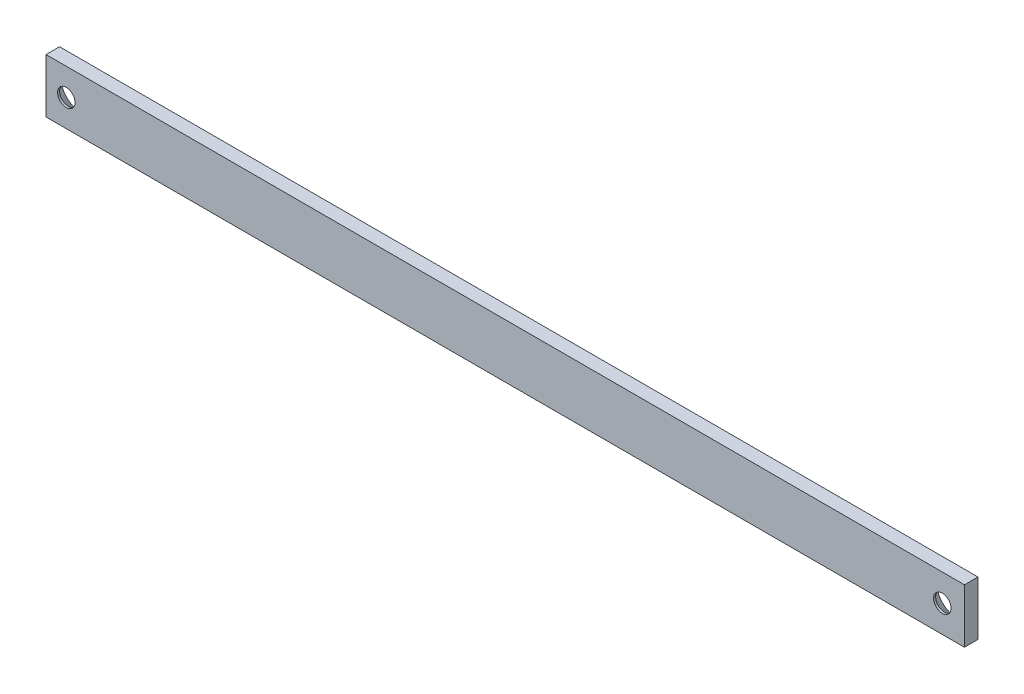
ISO-10303-21;
HEADER;
FILE_DESCRIPTION(('STEP AP214'),'2;1');
FILE_NAME('part.step','',(''),(''),'','','');
FILE_SCHEMA(('AUTOMOTIVE_DESIGN { 1 0 10303 214 1 1 1 1 }'));
ENDSEC;
DATA;
#1=APPLICATION_CONTEXT('core data for automotive mechanical design processes');
#2=APPLICATION_PROTOCOL_DEFINITION('international standard','automotive_design',2000,#1);
#3=PRODUCT_CONTEXT('',#1,'mechanical');
#4=PRODUCT('Part','Part','',(#3));
#5=PRODUCT_RELATED_PRODUCT_CATEGORY('part','',(#4));
#6=PRODUCT_DEFINITION_FORMATION('','',#4);
#7=PRODUCT_DEFINITION_CONTEXT('part definition',#1,'design');
#8=PRODUCT_DEFINITION('design','',#6,#7);
#9=PRODUCT_DEFINITION_SHAPE('','',#8);
#10=(LENGTH_UNIT() NAMED_UNIT(*) SI_UNIT(.MILLI.,.METRE.));
#11=(NAMED_UNIT(*) PLANE_ANGLE_UNIT() SI_UNIT($,.RADIAN.));
#12=(NAMED_UNIT(*) SI_UNIT($,.STERADIAN.) SOLID_ANGLE_UNIT());
#13=UNCERTAINTY_MEASURE_WITH_UNIT(LENGTH_MEASURE(1.E-05),#10,'distance_accuracy_value','');
#14=(GEOMETRIC_REPRESENTATION_CONTEXT(3) GLOBAL_UNCERTAINTY_ASSIGNED_CONTEXT((#13)) GLOBAL_UNIT_ASSIGNED_CONTEXT((#10,
#11,#12)) REPRESENTATION_CONTEXT('',''));
#15=CARTESIAN_POINT('',(0.,0.,0.));
#16=DIRECTION('',(0.,0.,1.));
#17=DIRECTION('',(1.,0.,0.));
#18=AXIS2_PLACEMENT_3D('',#15,#16,#17);
#19=CARTESIAN_POINT('',(-215.181102627937,-53.802479446265,-6.35));
#20=DIRECTION('',(1.,0.,0.));
#21=DIRECTION('',(0.,0.,-1.));
#22=AXIS2_PLACEMENT_3D('',#19,#20,#21);
#23=PLANE('',#22);
#24=DIRECTION('',(0.,1.,0.));
#25=VECTOR('',#24,1.);
#26=CARTESIAN_POINT('',(-215.181102627937,-53.802479446265,0.));
#27=LINE('',#26,#25);
#28=CARTESIAN_POINT('',(-215.181102627937,-53.802479446265,0.));
#29=VERTEX_POINT('',#28);
#30=CARTESIAN_POINT('',(-215.181102627937,-28.402479446265,0.));
#31=VERTEX_POINT('',#30);
#32=EDGE_CURVE('E73',#29,#31,#27,.T.);
#33=ORIENTED_EDGE('',*,*,#32,.T.);
#34=DIRECTION('',(0.,0.,1.));
#35=VECTOR('',#34,1.);
#36=CARTESIAN_POINT('',(-215.181102627937,-28.402479446265,-6.35));
#37=LINE('',#36,#35);
#38=CARTESIAN_POINT('',(-215.181102627937,-28.402479446265,-6.35));
#39=VERTEX_POINT('',#38);
#40=EDGE_CURVE('E11',#39,#31,#37,.T.);
#41=ORIENTED_EDGE('',*,*,#40,.F.);
#42=DIRECTION('',(0.,1.,0.));
#43=VECTOR('',#42,1.);
#44=CARTESIAN_POINT('',(-215.181102627937,-53.802479446265,-6.35));
#45=LINE('',#44,#43);
#46=CARTESIAN_POINT('',(-215.181102627937,-53.802479446265,-6.35));
#47=VERTEX_POINT('',#46);
#48=EDGE_CURVE('E96',#47,#39,#45,.T.);
#49=ORIENTED_EDGE('',*,*,#48,.F.);
#50=DIRECTION('',(0.,0.,1.));
#51=VECTOR('',#50,1.);
#52=CARTESIAN_POINT('',(-215.181102627937,-53.802479446265,-6.35));
#53=LINE('',#52,#51);
#54=EDGE_CURVE('E85',#47,#29,#53,.T.);
#55=ORIENTED_EDGE('',*,*,#54,.T.);
#56=EDGE_LOOP('',(#33,#41,#49,#55));
#57=FACE_BOUND('',#56,.T.);
#58=ADVANCED_FACE('F29',(#57),#23,.F.);
#59=CARTESIAN_POINT('',(-215.181102627937,-28.402479446265,-6.35));
#60=DIRECTION('',(0.,-1.,0.));
#61=DIRECTION('',(1.,0.,0.));
#62=AXIS2_PLACEMENT_3D('',#59,#60,#61);
#63=PLANE('',#62);
#64=DIRECTION('',(1.,0.,0.));
#65=VECTOR('',#64,1.);
#66=CARTESIAN_POINT('',(-215.181102627937,-28.402479446265,0.));
#67=LINE('',#66,#65);
#68=CARTESIAN_POINT('',(216.069998243082,-28.402479446265,0.));
#69=VERTEX_POINT('',#68);
#70=EDGE_CURVE('E69',#31,#69,#67,.T.);
#71=ORIENTED_EDGE('',*,*,#70,.T.);
#72=DIRECTION('',(0.,0.,1.));
#73=VECTOR('',#72,1.);
#74=CARTESIAN_POINT('',(216.069998243082,-28.402479446265,-6.35));
#75=LINE('',#74,#73);
#76=CARTESIAN_POINT('',(216.069998243082,-28.402479446265,-6.35));
#77=VERTEX_POINT('',#76);
#78=EDGE_CURVE('E36',#77,#69,#75,.T.);
#79=ORIENTED_EDGE('',*,*,#78,.F.);
#80=DIRECTION('',(1.,0.,0.));
#81=VECTOR('',#80,1.);
#82=CARTESIAN_POINT('',(-215.181102627937,-28.402479446265,-6.35));
#83=LINE('',#82,#81);
#84=EDGE_CURVE('E81',#39,#77,#83,.T.);
#85=ORIENTED_EDGE('',*,*,#84,.F.);
#86=ORIENTED_EDGE('',*,*,#40,.T.);
#87=EDGE_LOOP('',(#71,#79,#85,#86));
#88=FACE_BOUND('',#87,.T.);
#89=ADVANCED_FACE('F80',(#88),#63,.F.);
#90=CARTESIAN_POINT('',(216.069998243082,-53.802479446265,-6.35));
#91=DIRECTION('',(-1.,0.,0.));
#92=DIRECTION('',(0.,0.,1.));
#93=AXIS2_PLACEMENT_3D('',#90,#91,#92);
#94=PLANE('',#93);
#95=DIRECTION('',(0.,-1.,0.));
#96=VECTOR('',#95,1.);
#97=CARTESIAN_POINT('',(216.069998243082,-53.802479446265,0.));
#98=LINE('',#97,#96);
#99=CARTESIAN_POINT('',(216.069998243082,-53.802479446265,0.));
#100=VERTEX_POINT('',#99);
#101=EDGE_CURVE('E74',#69,#100,#98,.T.);
#102=ORIENTED_EDGE('',*,*,#101,.T.);
#103=DIRECTION('',(0.,0.,1.));
#104=VECTOR('',#103,1.);
#105=CARTESIAN_POINT('',(216.069998243082,-53.802479446265,-6.35));
#106=LINE('',#105,#104);
#107=CARTESIAN_POINT('',(216.069998243082,-53.802479446265,-6.35));
#108=VERTEX_POINT('',#107);
#109=EDGE_CURVE('E102',#108,#100,#106,.T.);
#110=ORIENTED_EDGE('',*,*,#109,.F.);
#111=DIRECTION('',(0.,-1.,0.));
#112=VECTOR('',#111,1.);
#113=CARTESIAN_POINT('',(216.069998243082,-53.802479446265,-6.35));
#114=LINE('',#113,#112);
#115=EDGE_CURVE('E48',#77,#108,#114,.T.);
#116=ORIENTED_EDGE('',*,*,#115,.F.);
#117=ORIENTED_EDGE('',*,*,#78,.T.);
#118=EDGE_LOOP('',(#102,#110,#116,#117));
#119=FACE_BOUND('',#118,.T.);
#120=ADVANCED_FACE('F105',(#119),#94,.F.);
#121=CARTESIAN_POINT('',(-215.181102627937,-53.802479446265,-6.35));
#122=DIRECTION('',(0.,1.,0.));
#123=DIRECTION('',(-1.,0.,0.));
#124=AXIS2_PLACEMENT_3D('',#121,#122,#123);
#125=PLANE('',#124);
#126=DIRECTION('',(-1.,0.,0.));
#127=VECTOR('',#126,1.);
#128=CARTESIAN_POINT('',(-215.181102627937,-53.802479446265,0.));
#129=LINE('',#128,#127);
#130=EDGE_CURVE('E94',#100,#29,#129,.T.);
#131=ORIENTED_EDGE('',*,*,#130,.T.);
#132=ORIENTED_EDGE('',*,*,#54,.F.);
#133=DIRECTION('',(-1.,0.,0.));
#134=VECTOR('',#133,1.);
#135=CARTESIAN_POINT('',(-215.181102627937,-53.802479446265,-6.35));
#136=LINE('',#135,#134);
#137=EDGE_CURVE('E43',#108,#47,#136,.T.);
#138=ORIENTED_EDGE('',*,*,#137,.F.);
#139=ORIENTED_EDGE('',*,*,#109,.T.);
#140=EDGE_LOOP('',(#131,#132,#138,#139));
#141=FACE_BOUND('',#140,.T.);
#142=ADVANCED_FACE('F107',(#141),#125,.F.);
#143=CARTESIAN_POINT('',(-215.181102627937,-28.402479446265,-6.35));
#144=DIRECTION('',(0.,0.,-1.));
#145=DIRECTION('',(-1.,0.,0.));
#146=AXIS2_PLACEMENT_3D('',#143,#144,#145);
#147=PLANE('',#146);
#148=CARTESIAN_POINT('',(205.656102627937,-41.1024794462649,-6.35));
#149=DIRECTION('',(0.,0.,-1.));
#150=DIRECTION('',(-1.,0.,0.));
#151=AXIS2_PLACEMENT_3D('',#148,#149,#150);
#152=CIRCLE('',#151,8.7727917);
#153=CARTESIAN_POINT('',(196.883310927937,-41.1024794462649,-6.35));
#154=VERTEX_POINT('',#153);
#155=EDGE_CURVE('E182',#154,#154,#152,.T.);
#156=ORIENTED_EDGE('',*,*,#155,.F.);
#157=EDGE_LOOP('',(#156));
#158=FACE_BOUND('',#157,.T.);
#159=CARTESIAN_POINT('',(-205.656102627937,-41.102479446265,-6.35));
#160=DIRECTION('',(0.,0.,-1.));
#161=DIRECTION('',(-1.,0.,0.));
#162=AXIS2_PLACEMENT_3D('',#159,#160,#161);
#163=CIRCLE('',#162,8.7727917);
#164=CARTESIAN_POINT('',(-214.428894327937,-41.102479446265,-6.35));
#165=VERTEX_POINT('',#164);
#166=EDGE_CURVE('E89',#165,#165,#163,.T.);
#167=ORIENTED_EDGE('',*,*,#166,.F.);
#168=EDGE_LOOP('',(#167));
#169=FACE_BOUND('',#168,.T.);
#170=ORIENTED_EDGE('',*,*,#48,.T.);
#171=ORIENTED_EDGE('',*,*,#84,.T.);
#172=ORIENTED_EDGE('',*,*,#115,.T.);
#173=ORIENTED_EDGE('',*,*,#137,.T.);
#174=EDGE_LOOP('',(#170,#171,#172,#173));
#175=FACE_BOUND('',#174,.T.);
#176=ADVANCED_FACE('F108',(#158,#169,#175),#147,.T.);
#177=CARTESIAN_POINT('',(-215.181102627937,-28.402479446265,0.));
#178=DIRECTION('',(0.,0.,-1.));
#179=DIRECTION('',(-1.,0.,0.));
#180=AXIS2_PLACEMENT_3D('',#177,#178,#179);
#181=PLANE('',#180);
#182=CARTESIAN_POINT('',(205.656102627937,-41.1024794462649,0.));
#183=DIRECTION('',(0.,0.,-1.));
#184=DIRECTION('',(-1.,0.,0.));
#185=AXIS2_PLACEMENT_3D('',#182,#183,#184);
#186=CIRCLE('',#185,4.1021);
#187=CARTESIAN_POINT('',(201.554002627937,-41.1024794462649,0.));
#188=VERTEX_POINT('',#187);
#189=EDGE_CURVE('E178',#188,#188,#186,.T.);
#190=ORIENTED_EDGE('',*,*,#189,.T.);
#191=EDGE_LOOP('',(#190));
#192=FACE_BOUND('',#191,.T.);
#193=CARTESIAN_POINT('',(-205.656102627937,-41.102479446265,0.));
#194=DIRECTION('',(0.,0.,-1.));
#195=DIRECTION('',(-1.,0.,0.));
#196=AXIS2_PLACEMENT_3D('',#193,#194,#195);
#197=CIRCLE('',#196,4.1021);
#198=CARTESIAN_POINT('',(-209.758202627937,-41.102479446265,0.));
#199=VERTEX_POINT('',#198);
#200=EDGE_CURVE('E86',#199,#199,#197,.T.);
#201=ORIENTED_EDGE('',*,*,#200,.T.);
#202=EDGE_LOOP('',(#201));
#203=FACE_BOUND('',#202,.T.);
#204=ORIENTED_EDGE('',*,*,#32,.F.);
#205=ORIENTED_EDGE('',*,*,#130,.F.);
#206=ORIENTED_EDGE('',*,*,#101,.F.);
#207=ORIENTED_EDGE('',*,*,#70,.F.);
#208=EDGE_LOOP('',(#204,#205,#206,#207));
#209=FACE_BOUND('',#208,.T.);
#210=ADVANCED_FACE('F70',(#192,#203,#209),#181,.F.);
#211=CARTESIAN_POINT('',(-205.656102627937,-41.102479446265,-6.35));
#212=DIRECTION('',(0.,0.,-1.));
#213=DIRECTION('',(-1.,0.,0.));
#214=AXIS2_PLACEMENT_3D('',#211,#212,#213);
#215=CONICAL_SURFACE('',#214,8.7727917,0.715584993317676);
#216=CARTESIAN_POINT('',(-205.656102627937,-41.102479446265,-0.976983828450609));
#217=DIRECTION('',(0.,0.,-1.));
#218=DIRECTION('',(-1.,0.,0.));
#219=AXIS2_PLACEMENT_3D('',#216,#217,#218);
#220=CIRCLE('',#219,4.1021);
#221=CARTESIAN_POINT('',(-209.758202627937,-41.102479446265,-0.976983828450609));
#222=VERTEX_POINT('',#221);
#223=EDGE_CURVE('E188',#222,#222,#220,.T.);
#224=ORIENTED_EDGE('',*,*,#223,.F.);
#225=EDGE_LOOP('',(#224));
#226=FACE_BOUND('',#225,.T.);
#227=ORIENTED_EDGE('',*,*,#166,.T.);
#228=EDGE_LOOP('',(#227));
#229=FACE_BOUND('',#228,.T.);
#230=ADVANCED_FACE('F116',(#226,#229),#215,.F.);
#231=CARTESIAN_POINT('',(-205.656102627937,-41.102479446265,-6.35));
#232=DIRECTION('',(0.,0.,-1.));
#233=DIRECTION('',(-1.,0.,0.));
#234=AXIS2_PLACEMENT_3D('',#231,#232,#233);
#235=CYLINDRICAL_SURFACE('',#234,4.1021);
#236=ORIENTED_EDGE('',*,*,#200,.F.);
#237=EDGE_LOOP('',(#236));
#238=FACE_BOUND('',#237,.T.);
#239=ORIENTED_EDGE('',*,*,#223,.T.);
#240=EDGE_LOOP('',(#239));
#241=FACE_BOUND('',#240,.T.);
#242=ADVANCED_FACE('F149',(#238,#241),#235,.F.);
#243=CARTESIAN_POINT('',(205.656102627937,-41.1024794462649,-6.35));
#244=DIRECTION('',(0.,0.,-1.));
#245=DIRECTION('',(-1.,0.,0.));
#246=AXIS2_PLACEMENT_3D('',#243,#244,#245);
#247=CONICAL_SURFACE('',#246,8.7727917,0.715584993317676);
#248=CARTESIAN_POINT('',(205.656102627937,-41.1024794462649,-0.976983828450609));
#249=DIRECTION('',(0.,0.,-1.));
#250=DIRECTION('',(-1.,0.,0.));
#251=AXIS2_PLACEMENT_3D('',#248,#249,#250);
#252=CIRCLE('',#251,4.1021);
#253=CARTESIAN_POINT('',(201.554002627937,-41.1024794462649,-0.976983828450609));
#254=VERTEX_POINT('',#253);
#255=EDGE_CURVE('E181',#254,#254,#252,.T.);
#256=ORIENTED_EDGE('',*,*,#255,.F.);
#257=EDGE_LOOP('',(#256));
#258=FACE_BOUND('',#257,.T.);
#259=ORIENTED_EDGE('',*,*,#155,.T.);
#260=EDGE_LOOP('',(#259));
#261=FACE_BOUND('',#260,.T.);
#262=ADVANCED_FACE('F157',(#258,#261),#247,.F.);
#263=CARTESIAN_POINT('',(205.656102627937,-41.1024794462649,-6.35));
#264=DIRECTION('',(0.,0.,-1.));
#265=DIRECTION('',(-1.,0.,0.));
#266=AXIS2_PLACEMENT_3D('',#263,#264,#265);
#267=CYLINDRICAL_SURFACE('',#266,4.1021);
#268=ORIENTED_EDGE('',*,*,#189,.F.);
#269=EDGE_LOOP('',(#268));
#270=FACE_BOUND('',#269,.T.);
#271=ORIENTED_EDGE('',*,*,#255,.T.);
#272=EDGE_LOOP('',(#271));
#273=FACE_BOUND('',#272,.T.);
#274=ADVANCED_FACE('F165',(#270,#273),#267,.F.);
#275=CLOSED_SHELL('',(#58,#89,#120,#142,#176,#210,#230,#242,#262,#274));
#276=MANIFOLD_SOLID_BREP('B2',#275);
#277=ADVANCED_BREP_SHAPE_REPRESENTATION('',(#18,#276),#14);
#278=SHAPE_DEFINITION_REPRESENTATION(#9,#277);
ENDSEC;
END-ISO-10303-21;
